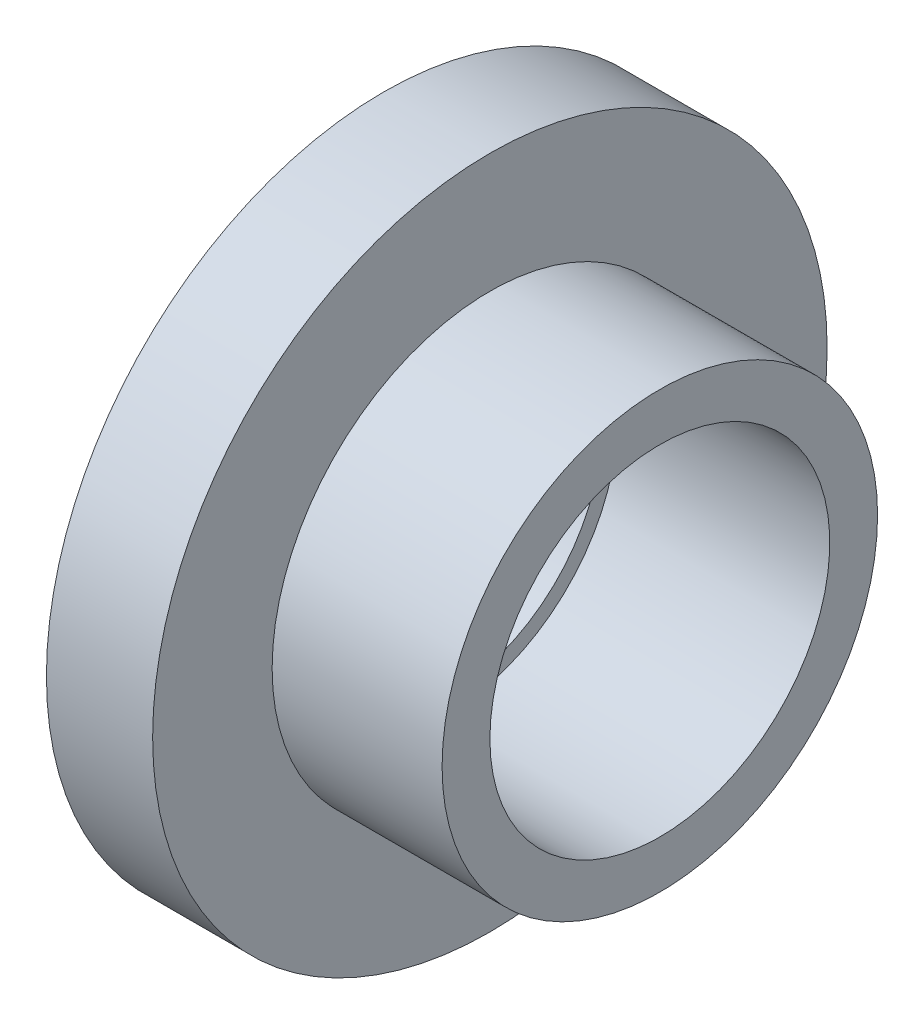
ISO-10303-21;
HEADER;
FILE_DESCRIPTION(('STEP AP214'),'2;1');
FILE_NAME('part.step','',(''),(''),'','','');
FILE_SCHEMA(('AUTOMOTIVE_DESIGN { 1 0 10303 214 1 1 1 1 }'));
ENDSEC;
DATA;
#1=APPLICATION_CONTEXT('core data for automotive mechanical design processes');
#2=APPLICATION_PROTOCOL_DEFINITION('international standard','automotive_design',2000,#1);
#3=PRODUCT_CONTEXT('',#1,'mechanical');
#4=PRODUCT('Part','Part','',(#3));
#5=PRODUCT_RELATED_PRODUCT_CATEGORY('part','',(#4));
#6=PRODUCT_DEFINITION_FORMATION('','',#4);
#7=PRODUCT_DEFINITION_CONTEXT('part definition',#1,'design');
#8=PRODUCT_DEFINITION('design','',#6,#7);
#9=PRODUCT_DEFINITION_SHAPE('','',#8);
#10=(LENGTH_UNIT() NAMED_UNIT(*) SI_UNIT(.MILLI.,.METRE.));
#11=(NAMED_UNIT(*) PLANE_ANGLE_UNIT() SI_UNIT($,.RADIAN.));
#12=(NAMED_UNIT(*) SI_UNIT($,.STERADIAN.) SOLID_ANGLE_UNIT());
#13=UNCERTAINTY_MEASURE_WITH_UNIT(LENGTH_MEASURE(1.E-05),#10,'distance_accuracy_value','');
#14=(GEOMETRIC_REPRESENTATION_CONTEXT(3) GLOBAL_UNCERTAINTY_ASSIGNED_CONTEXT((#13)) GLOBAL_UNIT_ASSIGNED_CONTEXT((#10,
#11,#12)) REPRESENTATION_CONTEXT('',''));
#15=CARTESIAN_POINT('',(0.,0.,0.));
#16=DIRECTION('',(0.,0.,1.));
#17=DIRECTION('',(1.,0.,0.));
#18=AXIS2_PLACEMENT_3D('',#15,#16,#17);
#19=CARTESIAN_POINT('',(4.,0.,0.));
#20=DIRECTION('',(-1.,0.,0.));
#21=DIRECTION('',(0.,0.,1.));
#22=AXIS2_PLACEMENT_3D('',#19,#20,#21);
#23=CYLINDRICAL_SURFACE('',#22,20.5);
#24=CARTESIAN_POINT('',(4.,0.,0.));
#25=DIRECTION('',(-1.,0.,0.));
#26=DIRECTION('',(0.,0.,1.));
#27=AXIS2_PLACEMENT_3D('',#24,#25,#26);
#28=CIRCLE('',#27,20.5);
#29=CARTESIAN_POINT('',(4.,0.,20.5));
#30=VERTEX_POINT('',#29);
#31=EDGE_CURVE('E38',#30,#30,#28,.T.);
#32=ORIENTED_EDGE('',*,*,#31,.F.);
#33=EDGE_LOOP('',(#32));
#34=FACE_BOUND('',#33,.T.);
#35=CARTESIAN_POINT('',(20.,0.,0.));
#36=DIRECTION('',(-1.,0.,0.));
#37=DIRECTION('',(0.,0.,1.));
#38=AXIS2_PLACEMENT_3D('',#35,#36,#37);
#39=CIRCLE('',#38,20.5);
#40=CARTESIAN_POINT('',(20.,0.,20.5));
#41=VERTEX_POINT('',#40);
#42=EDGE_CURVE('E16',#41,#41,#39,.F.);
#43=ORIENTED_EDGE('',*,*,#42,.F.);
#44=EDGE_LOOP('',(#43));
#45=FACE_BOUND('',#44,.T.);
#46=ADVANCED_FACE('F13',(#34,#45),#23,.T.);
#47=CARTESIAN_POINT('',(20.,20.5,20.7460021084075));
#48=DIRECTION('',(1.,0.,0.));
#49=DIRECTION('',(0.,-1.,0.));
#50=AXIS2_PLACEMENT_3D('',#47,#48,#49);
#51=PLANE('',#50);
#52=CARTESIAN_POINT('',(20.,0.,0.));
#53=DIRECTION('',(-1.,0.,0.));
#54=DIRECTION('',(0.,0.,1.));
#55=AXIS2_PLACEMENT_3D('',#52,#53,#54);
#56=CIRCLE('',#55,16.);
#57=CARTESIAN_POINT('',(20.,0.,16.));
#58=VERTEX_POINT('',#57);
#59=EDGE_CURVE('E36',#58,#58,#56,.F.);
#60=ORIENTED_EDGE('',*,*,#59,.F.);
#61=EDGE_LOOP('',(#60));
#62=FACE_BOUND('',#61,.T.);
#63=ORIENTED_EDGE('',*,*,#42,.T.);
#64=EDGE_LOOP('',(#63));
#65=FACE_BOUND('',#64,.T.);
#66=ADVANCED_FACE('F45',(#62,#65),#51,.T.);
#67=CARTESIAN_POINT('',(4.,31.75,32.131001054169));
#68=DIRECTION('',(1.,0.,0.));
#69=DIRECTION('',(0.,-1.,0.));
#70=AXIS2_PLACEMENT_3D('',#67,#68,#69);
#71=PLANE('',#70);
#72=ORIENTED_EDGE('',*,*,#31,.T.);
#73=EDGE_LOOP('',(#72));
#74=FACE_BOUND('',#73,.T.);
#75=CARTESIAN_POINT('',(4.,0.,0.));
#76=DIRECTION('',(-1.,0.,0.));
#77=DIRECTION('',(0.,0.,1.));
#78=AXIS2_PLACEMENT_3D('',#75,#76,#77);
#79=CIRCLE('',#78,31.75);
#80=CARTESIAN_POINT('',(4.,0.,31.75));
#81=VERTEX_POINT('',#80);
#82=EDGE_CURVE('E33',#81,#81,#79,.T.);
#83=ORIENTED_EDGE('',*,*,#82,.F.);
#84=EDGE_LOOP('',(#83));
#85=FACE_BOUND('',#84,.T.);
#86=ADVANCED_FACE('F53',(#74,#85),#71,.T.);
#87=CARTESIAN_POINT('',(20.,0.,0.));
#88=DIRECTION('',(-1.,0.,0.));
#89=DIRECTION('',(0.,0.,1.));
#90=AXIS2_PLACEMENT_3D('',#87,#88,#89);
#91=CYLINDRICAL_SURFACE('',#90,16.);
#92=ORIENTED_EDGE('',*,*,#59,.T.);
#93=EDGE_LOOP('',(#92));
#94=FACE_BOUND('',#93,.T.);
#95=CARTESIAN_POINT('',(0.,0.,0.));
#96=DIRECTION('',(-1.,0.,0.));
#97=DIRECTION('',(0.,0.,1.));
#98=AXIS2_PLACEMENT_3D('',#95,#96,#97);
#99=CIRCLE('',#98,16.);
#100=CARTESIAN_POINT('',(0.,0.,16.));
#101=VERTEX_POINT('',#100);
#102=EDGE_CURVE('E30',#101,#101,#99,.F.);
#103=ORIENTED_EDGE('',*,*,#102,.F.);
#104=EDGE_LOOP('',(#103));
#105=FACE_BOUND('',#104,.T.);
#106=ADVANCED_FACE('F73',(#94,#105),#91,.F.);
#107=CARTESIAN_POINT('',(-6.,0.,0.));
#108=DIRECTION('',(-1.,0.,0.));
#109=DIRECTION('',(0.,0.,1.));
#110=AXIS2_PLACEMENT_3D('',#107,#108,#109);
#111=CYLINDRICAL_SURFACE('',#110,31.75);
#112=CARTESIAN_POINT('',(-6.,0.,0.));
#113=DIRECTION('',(-1.,0.,0.));
#114=DIRECTION('',(0.,0.,1.));
#115=AXIS2_PLACEMENT_3D('',#112,#113,#114);
#116=CIRCLE('',#115,31.75);
#117=CARTESIAN_POINT('',(-6.,0.,31.75));
#118=VERTEX_POINT('',#117);
#119=EDGE_CURVE('E25',#118,#118,#116,.T.);
#120=ORIENTED_EDGE('',*,*,#119,.F.);
#121=EDGE_LOOP('',(#120));
#122=FACE_BOUND('',#121,.T.);
#123=ORIENTED_EDGE('',*,*,#82,.T.);
#124=EDGE_LOOP('',(#123));
#125=FACE_BOUND('',#124,.T.);
#126=ADVANCED_FACE('F69',(#122,#125),#111,.T.);
#127=CARTESIAN_POINT('',(0.,16.,16.1920021082986));
#128=DIRECTION('',(1.,0.,0.));
#129=DIRECTION('',(0.,-1.,0.));
#130=AXIS2_PLACEMENT_3D('',#127,#128,#129);
#131=PLANE('',#130);
#132=CARTESIAN_POINT('',(0.,0.,0.));
#133=DIRECTION('',(-1.,0.,0.));
#134=DIRECTION('',(0.,0.,1.));
#135=AXIS2_PLACEMENT_3D('',#132,#133,#134);
#136=CIRCLE('',#135,14.5);
#137=CARTESIAN_POINT('',(0.,0.,14.5));
#138=VERTEX_POINT('',#137);
#139=EDGE_CURVE('E20',#138,#138,#136,.F.);
#140=ORIENTED_EDGE('',*,*,#139,.F.);
#141=EDGE_LOOP('',(#140));
#142=FACE_BOUND('',#141,.T.);
#143=ORIENTED_EDGE('',*,*,#102,.T.);
#144=EDGE_LOOP('',(#143));
#145=FACE_BOUND('',#144,.T.);
#146=ADVANCED_FACE('F63',(#142,#145),#131,.T.);
#147=CARTESIAN_POINT('',(-6.,-31.75,32.131001054169));
#148=DIRECTION('',(-1.,0.,0.));
#149=DIRECTION('',(0.,1.,0.));
#150=AXIS2_PLACEMENT_3D('',#147,#148,#149);
#151=PLANE('',#150);
#152=CARTESIAN_POINT('',(-6.,0.,0.));
#153=DIRECTION('',(-1.,0.,0.));
#154=DIRECTION('',(0.,0.,1.));
#155=AXIS2_PLACEMENT_3D('',#152,#153,#154);
#156=CIRCLE('',#155,14.5);
#157=CARTESIAN_POINT('',(-6.,0.,14.5));
#158=VERTEX_POINT('',#157);
#159=EDGE_CURVE('E8',#158,#158,#156,.T.);
#160=ORIENTED_EDGE('',*,*,#159,.F.);
#161=EDGE_LOOP('',(#160));
#162=FACE_BOUND('',#161,.T.);
#163=ORIENTED_EDGE('',*,*,#119,.T.);
#164=EDGE_LOOP('',(#163));
#165=FACE_BOUND('',#164,.T.);
#166=ADVANCED_FACE('F57',(#162,#165),#151,.T.);
#167=CARTESIAN_POINT('',(0.,0.,0.));
#168=DIRECTION('',(-1.,0.,0.));
#169=DIRECTION('',(0.,0.,1.));
#170=AXIS2_PLACEMENT_3D('',#167,#168,#169);
#171=CYLINDRICAL_SURFACE('',#170,14.5);
#172=ORIENTED_EDGE('',*,*,#139,.T.);
#173=EDGE_LOOP('',(#172));
#174=FACE_BOUND('',#173,.T.);
#175=ORIENTED_EDGE('',*,*,#159,.T.);
#176=EDGE_LOOP('',(#175));
#177=FACE_BOUND('',#176,.T.);
#178=ADVANCED_FACE('F55',(#174,#177),#171,.F.);
#179=CLOSED_SHELL('',(#46,#66,#86,#106,#126,#146,#166,#178));
#180=MANIFOLD_SOLID_BREP('B1',#179);
#181=ADVANCED_BREP_SHAPE_REPRESENTATION('',(#18,#180),#14);
#182=SHAPE_DEFINITION_REPRESENTATION(#9,#181);
ENDSEC;
END-ISO-10303-21;
